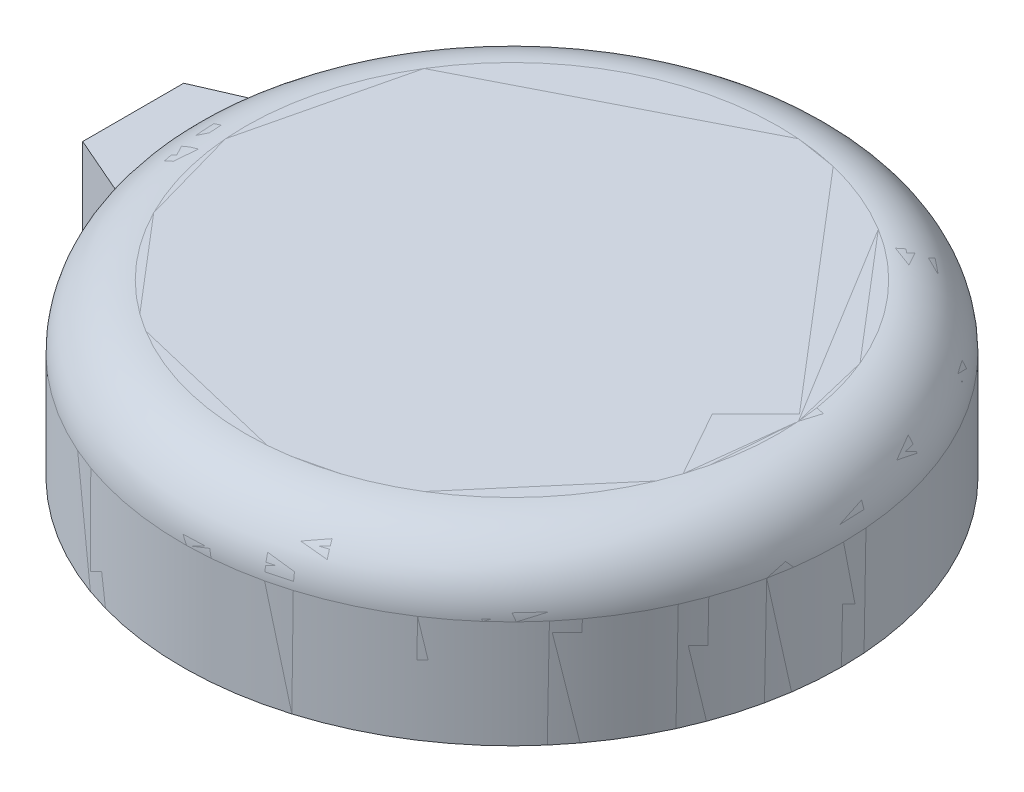
ISO-10303-21;
HEADER;
FILE_DESCRIPTION(('STEP AP214'),'2;1');
FILE_NAME('part.step','',(''),(''),'','','');
FILE_SCHEMA(('AUTOMOTIVE_DESIGN { 1 0 10303 214 1 1 1 1 }'));
ENDSEC;
DATA;
#1=APPLICATION_CONTEXT('core data for automotive mechanical design processes');
#2=APPLICATION_PROTOCOL_DEFINITION('international standard','automotive_design',2000,#1);
#3=PRODUCT_CONTEXT('',#1,'mechanical');
#4=PRODUCT('Part','Part','',(#3));
#5=PRODUCT_RELATED_PRODUCT_CATEGORY('part','',(#4));
#6=PRODUCT_DEFINITION_FORMATION('','',#4);
#7=PRODUCT_DEFINITION_CONTEXT('part definition',#1,'design');
#8=PRODUCT_DEFINITION('design','',#6,#7);
#9=PRODUCT_DEFINITION_SHAPE('','',#8);
#10=(LENGTH_UNIT() NAMED_UNIT(*) SI_UNIT(.MILLI.,.METRE.));
#11=(NAMED_UNIT(*) PLANE_ANGLE_UNIT() SI_UNIT($,.RADIAN.));
#12=(NAMED_UNIT(*) SI_UNIT($,.STERADIAN.) SOLID_ANGLE_UNIT());
#13=UNCERTAINTY_MEASURE_WITH_UNIT(LENGTH_MEASURE(1.E-05),#10,'distance_accuracy_value','');
#14=(GEOMETRIC_REPRESENTATION_CONTEXT(3) GLOBAL_UNCERTAINTY_ASSIGNED_CONTEXT((#13)) GLOBAL_UNIT_ASSIGNED_CONTEXT((#10,
#11,#12)) REPRESENTATION_CONTEXT('',''));
#15=CARTESIAN_POINT('',(0.,0.,0.));
#16=DIRECTION('',(0.,0.,1.));
#17=DIRECTION('',(1.,0.,0.));
#18=AXIS2_PLACEMENT_3D('',#15,#16,#17);
#19=CARTESIAN_POINT('',(26.1,0.,0.));
#20=DIRECTION('',(0.,-1.,0.));
#21=DIRECTION('',(0.,0.,-1.));
#22=AXIS2_PLACEMENT_3D('',#19,#20,#21);
#23=PLANE('',#22);
#24=CARTESIAN_POINT('',(0.,0.,0.));
#25=DIRECTION('',(0.,1.,0.));
#26=DIRECTION('',(1.,0.,0.));
#27=AXIS2_PLACEMENT_3D('',#24,#25,#26);
#28=CIRCLE('',#27,26.1);
#29=CARTESIAN_POINT('',(-25.4009842328993,0.,6.));
#30=VERTEX_POINT('',#29);
#31=CARTESIAN_POINT('',(-25.4009842328993,0.,-6.));
#32=VERTEX_POINT('',#31);
#33=EDGE_CURVE('P0_E82',#30,#32,#28,.T.);
#34=ORIENTED_EDGE('',*,*,#33,.F.);
#35=DIRECTION('',(-0.917038852333646,0.,-0.398797872750834));
#36=VECTOR('',#35,1.);
#37=CARTESIAN_POINT('',(-25.4009842328993,0.,6.));
#38=LINE('',#37,#36);
#39=CARTESIAN_POINT('',(-30.,0.,4.));
#40=VERTEX_POINT('',#39);
#41=EDGE_CURVE('P0_E112',#30,#40,#38,.T.);
#42=ORIENTED_EDGE('',*,*,#41,.T.);
#43=DIRECTION('',(0.,0.,-1.));
#44=VECTOR('',#43,1.);
#45=CARTESIAN_POINT('',(-30.,0.,4.));
#46=LINE('',#45,#44);
#47=CARTESIAN_POINT('',(-30.,0.,-4.));
#48=VERTEX_POINT('',#47);
#49=EDGE_CURVE('P0_E75',#40,#48,#46,.T.);
#50=ORIENTED_EDGE('',*,*,#49,.T.);
#51=DIRECTION('',(0.917038852333646,0.,-0.398797872750834));
#52=VECTOR('',#51,1.);
#53=CARTESIAN_POINT('',(-30.,0.,-4.));
#54=LINE('',#53,#52);
#55=EDGE_CURVE('P0_E99',#48,#32,#54,.T.);
#56=ORIENTED_EDGE('',*,*,#55,.T.);
#57=EDGE_LOOP('',(#34,#42,#50,#56));
#58=FACE_BOUND('',#57,.T.);
#59=ADVANCED_FACE('P0_F32',(#58),#23,.T.);
#60=CARTESIAN_POINT('',(0.,13.5,0.));
#61=DIRECTION('',(0.,1.,0.));
#62=DIRECTION('',(1.,0.,0.));
#63=AXIS2_PLACEMENT_3D('',#60,#61,#62);
#64=PLANE('',#63);
#65=CARTESIAN_POINT('',(0.,13.5,0.));
#66=DIRECTION('',(0.,1.,0.));
#67=DIRECTION('',(1.,0.,0.));
#68=AXIS2_PLACEMENT_3D('',#65,#66,#67);
#69=CIRCLE('',#68,21.1);
#70=CARTESIAN_POINT('',(0.,13.5,-21.1));
#71=VERTEX_POINT('',#70);
#72=EDGE_CURVE('P0_E129',#71,#71,#69,.T.);
#73=ORIENTED_EDGE('',*,*,#72,.T.);
#74=EDGE_LOOP('',(#73));
#75=FACE_BOUND('',#74,.T.);
#76=ADVANCED_FACE('P0_F169',(#75),#64,.T.);
#77=CARTESIAN_POINT('',(0.,8.5,0.));
#78=DIRECTION('',(0.,1.,0.));
#79=DIRECTION('',(0.,0.,1.));
#80=AXIS2_PLACEMENT_3D('',#77,#78,#79);
#81=TOROIDAL_SURFACE('',#80,21.1,5.);
#82=ORIENTED_EDGE('',*,*,#72,.F.);
#83=CARTESIAN_POINT('',(0.,8.5,-21.1));
#84=DIRECTION('',(-1.,0.,0.));
#85=DIRECTION('',(0.,0.,-1.));
#86=AXIS2_PLACEMENT_3D('',#83,#84,#85);
#87=CIRCLE('',#86,5.);
#88=CARTESIAN_POINT('',(0.,8.5,-26.1));
#89=VERTEX_POINT('',#88);
#90=EDGE_CURVE('P0_E42',#71,#89,#87,.T.);
#91=ORIENTED_EDGE('',*,*,#90,.T.);
#92=CARTESIAN_POINT('',(0.,8.5,0.));
#93=DIRECTION('',(0.,1.,0.));
#94=DIRECTION('',(1.,0.,0.));
#95=AXIS2_PLACEMENT_3D('',#92,#93,#94);
#96=CIRCLE('',#95,26.1);
#97=CARTESIAN_POINT('',(-25.4009842328993,8.5,-6.));
#98=VERTEX_POINT('',#97);
#99=EDGE_CURVE('P0_E140',#89,#98,#96,.T.);
#100=ORIENTED_EDGE('',*,*,#99,.T.);
#101=CARTESIAN_POINT('',(0.,8.5,0.));
#102=DIRECTION('',(0.,1.,0.));
#103=DIRECTION('',(1.,0.,0.));
#104=AXIS2_PLACEMENT_3D('',#101,#102,#103);
#105=CIRCLE('',#104,26.1);
#106=CARTESIAN_POINT('',(-25.4009842328993,8.5,6.));
#107=VERTEX_POINT('',#106);
#108=EDGE_CURVE('P0_E117',#98,#107,#105,.T.);
#109=ORIENTED_EDGE('',*,*,#108,.T.);
#110=CARTESIAN_POINT('',(0.,8.5,0.));
#111=DIRECTION('',(0.,1.,0.));
#112=DIRECTION('',(1.,0.,0.));
#113=AXIS2_PLACEMENT_3D('',#110,#111,#112);
#114=CIRCLE('',#113,26.1);
#115=EDGE_CURVE('P0_E131',#107,#89,#114,.T.);
#116=ORIENTED_EDGE('',*,*,#115,.T.);
#117=ORIENTED_EDGE('',*,*,#90,.F.);
#118=EDGE_LOOP('',(#82,#91,#100,#109,#116,#117));
#119=FACE_BOUND('',#118,.T.);
#120=ADVANCED_FACE('P0_F173',(#119),#81,.T.);
#121=CARTESIAN_POINT('',(0.,4.25,0.));
#122=DIRECTION('',(0.,1.,0.));
#123=DIRECTION('',(1.,0.,0.));
#124=AXIS2_PLACEMENT_3D('',#121,#122,#123);
#125=CYLINDRICAL_SURFACE('',#124,26.1);
#126=DIRECTION('',(0.,-1.,0.));
#127=VECTOR('',#126,1.);
#128=CARTESIAN_POINT('',(-25.4009842328993,4.25,6.));
#129=LINE('',#128,#127);
#130=EDGE_CURVE('P0_E123',#107,#30,#129,.T.);
#131=ORIENTED_EDGE('',*,*,#130,.T.);
#132=ORIENTED_EDGE('',*,*,#33,.T.);
#133=DIRECTION('',(0.,1.,0.));
#134=VECTOR('',#133,1.);
#135=CARTESIAN_POINT('',(-25.4009842328993,4.25,-6.));
#136=LINE('',#135,#134);
#137=EDGE_CURVE('P0_E105',#32,#98,#136,.T.);
#138=ORIENTED_EDGE('',*,*,#137,.T.);
#139=ORIENTED_EDGE('',*,*,#99,.F.);
#140=ORIENTED_EDGE('',*,*,#115,.F.);
#141=EDGE_LOOP('',(#131,#132,#138,#139,#140));
#142=FACE_BOUND('',#141,.T.);
#143=ADVANCED_FACE('P0_F177',(#142),#125,.T.);
#144=CARTESIAN_POINT('',(-27.7004921164497,10.,0.));
#145=DIRECTION('',(0.,-1.,0.));
#146=DIRECTION('',(0.,0.,-1.));
#147=AXIS2_PLACEMENT_3D('',#144,#145,#146);
#148=PLANE('',#147);
#149=DIRECTION('',(-0.917038852333646,0.,0.398797872750834));
#150=VECTOR('',#149,1.);
#151=CARTESIAN_POINT('',(-30.,10.,-4.));
#152=LINE('',#151,#150);
#153=CARTESIAN_POINT('',(-25.4009842328993,10.,-6.));
#154=VERTEX_POINT('',#153);
#155=CARTESIAN_POINT('',(-30.,10.,-4.));
#156=VERTEX_POINT('',#155);
#157=EDGE_CURVE('P0_E106',#154,#156,#152,.T.);
#158=ORIENTED_EDGE('',*,*,#157,.T.);
#159=DIRECTION('',(0.,0.,1.));
#160=VECTOR('',#159,1.);
#161=CARTESIAN_POINT('',(-30.,10.,4.));
#162=LINE('',#161,#160);
#163=CARTESIAN_POINT('',(-30.,10.,4.));
#164=VERTEX_POINT('',#163);
#165=EDGE_CURVE('P0_E109',#156,#164,#162,.T.);
#166=ORIENTED_EDGE('',*,*,#165,.T.);
#167=DIRECTION('',(0.917038852333646,0.,0.398797872750834));
#168=VECTOR('',#167,1.);
#169=CARTESIAN_POINT('',(-25.4009842328993,10.,6.));
#170=LINE('',#169,#168);
#171=CARTESIAN_POINT('',(-25.4009842328993,10.,6.));
#172=VERTEX_POINT('',#171);
#173=EDGE_CURVE('P0_E88',#164,#172,#170,.T.);
#174=ORIENTED_EDGE('',*,*,#173,.T.);
#175=CARTESIAN_POINT('',(0.,10.,0.));
#176=DIRECTION('',(0.,-1.,0.));
#177=DIRECTION('',(-1.,0.,0.));
#178=AXIS2_PLACEMENT_3D('',#175,#176,#177);
#179=CIRCLE('',#178,26.1);
#180=EDGE_CURVE('P0_E126',#172,#154,#179,.T.);
#181=ORIENTED_EDGE('',*,*,#180,.T.);
#182=EDGE_LOOP('',(#158,#166,#174,#181));
#183=FACE_BOUND('',#182,.T.);
#184=ADVANCED_FACE('P0_F34',(#183),#148,.F.);
#185=CARTESIAN_POINT('',(-25.4009842328993,0.,-6.));
#186=DIRECTION('',(-0.398797872750833,0.,-0.917038852333646));
#187=DIRECTION('',(-0.917038852333646,0.,0.398797872750833));
#188=AXIS2_PLACEMENT_3D('',#185,#186,#187);
#189=PLANE('',#188);
#190=ORIENTED_EDGE('',*,*,#55,.F.);
#191=DIRECTION('',(0.,1.,0.));
#192=VECTOR('',#191,1.);
#193=CARTESIAN_POINT('',(-30.,0.,-4.));
#194=LINE('',#193,#192);
#195=EDGE_CURVE('P0_E101',#48,#156,#194,.T.);
#196=ORIENTED_EDGE('',*,*,#195,.T.);
#197=ORIENTED_EDGE('',*,*,#157,.F.);
#198=DIRECTION('',(0.,1.,0.));
#199=VECTOR('',#198,1.);
#200=CARTESIAN_POINT('',(-25.4009842328993,0.,-6.));
#201=LINE('',#200,#199);
#202=EDGE_CURVE('P0_E120',#98,#154,#201,.T.);
#203=ORIENTED_EDGE('',*,*,#202,.F.);
#204=ORIENTED_EDGE('',*,*,#137,.F.);
#205=EDGE_LOOP('',(#190,#196,#197,#203,#204));
#206=FACE_BOUND('',#205,.T.);
#207=ADVANCED_FACE('P0_F100',(#206),#189,.T.);
#208=CARTESIAN_POINT('',(-30.,0.,-4.));
#209=DIRECTION('',(-1.,0.,0.));
#210=DIRECTION('',(0.,0.,1.));
#211=AXIS2_PLACEMENT_3D('',#208,#209,#210);
#212=PLANE('',#211);
#213=CARTESIAN_POINT('',(-30.,5.00000000000001,0.));
#214=DIRECTION('',(-1.,0.,0.));
#215=DIRECTION('',(0.,0.,1.));
#216=AXIS2_PLACEMENT_3D('',#213,#214,#215);
#217=CIRCLE('',#216,1.5);
#218=CARTESIAN_POINT('',(-30.,5.00000000000001,1.5));
#219=VERTEX_POINT('',#218);
#220=EDGE_CURVE('P0_E11',#219,#219,#217,.T.);
#221=ORIENTED_EDGE('',*,*,#220,.F.);
#222=EDGE_LOOP('',(#221));
#223=FACE_BOUND('',#222,.T.);
#224=ORIENTED_EDGE('',*,*,#49,.F.);
#225=DIRECTION('',(0.,1.,0.));
#226=VECTOR('',#225,1.);
#227=CARTESIAN_POINT('',(-30.,0.,4.));
#228=LINE('',#227,#226);
#229=EDGE_CURVE('P0_E36',#40,#164,#228,.T.);
#230=ORIENTED_EDGE('',*,*,#229,.T.);
#231=ORIENTED_EDGE('',*,*,#165,.F.);
#232=ORIENTED_EDGE('',*,*,#195,.F.);
#233=EDGE_LOOP('',(#224,#230,#231,#232));
#234=FACE_BOUND('',#233,.T.);
#235=ADVANCED_FACE('P0_F108',(#223,#234),#212,.T.);
#236=CARTESIAN_POINT('',(-30.,0.,4.));
#237=DIRECTION('',(-0.398797872750833,0.,0.917038852333646));
#238=DIRECTION('',(0.,1.,0.));
#239=AXIS2_PLACEMENT_3D('',#236,#237,#238);
#240=PLANE('',#239);
#241=ORIENTED_EDGE('',*,*,#41,.F.);
#242=ORIENTED_EDGE('',*,*,#130,.F.);
#243=DIRECTION('',(0.,1.,0.));
#244=VECTOR('',#243,1.);
#245=CARTESIAN_POINT('',(-25.4009842328993,0.,6.));
#246=LINE('',#245,#244);
#247=EDGE_CURVE('P0_E133',#107,#172,#246,.T.);
#248=ORIENTED_EDGE('',*,*,#247,.T.);
#249=ORIENTED_EDGE('',*,*,#173,.F.);
#250=ORIENTED_EDGE('',*,*,#229,.F.);
#251=EDGE_LOOP('',(#241,#242,#248,#249,#250));
#252=FACE_BOUND('',#251,.T.);
#253=ADVANCED_FACE('P0_F159',(#252),#240,.T.);
#254=CARTESIAN_POINT('',(0.,0.,0.));
#255=DIRECTION('',(0.,1.,0.));
#256=DIRECTION('',(-1.,0.,0.));
#257=AXIS2_PLACEMENT_3D('',#254,#255,#256);
#258=CYLINDRICAL_SURFACE('',#257,26.1);
#259=ORIENTED_EDGE('',*,*,#108,.F.);
#260=ORIENTED_EDGE('',*,*,#202,.T.);
#261=ORIENTED_EDGE('',*,*,#180,.F.);
#262=ORIENTED_EDGE('',*,*,#247,.F.);
#263=EDGE_LOOP('',(#259,#260,#261,#262));
#264=FACE_BOUND('',#263,.T.);
#265=ADVANCED_FACE('P0_F154',(#264),#258,.F.);
#266=CARTESIAN_POINT('',(-31.,5.00000000000001,0.));
#267=DIRECTION('',(1.,0.,0.));
#268=DIRECTION('',(0.,0.,-1.));
#269=AXIS2_PLACEMENT_3D('',#266,#267,#268);
#270=CYLINDRICAL_SURFACE('',#269,1.5);
#271=CARTESIAN_POINT('',(-31.,5.00000000000001,0.));
#272=DIRECTION('',(-1.,0.,0.));
#273=DIRECTION('',(0.,0.,1.));
#274=AXIS2_PLACEMENT_3D('',#271,#272,#273);
#275=CIRCLE('',#274,1.5);
#276=CARTESIAN_POINT('',(-31.,5.00000000000001,1.5));
#277=VERTEX_POINT('',#276);
#278=EDGE_CURVE('P0_E121',#277,#277,#275,.T.);
#279=ORIENTED_EDGE('',*,*,#278,.F.);
#280=EDGE_LOOP('',(#279));
#281=FACE_BOUND('',#280,.T.);
#282=ORIENTED_EDGE('',*,*,#220,.T.);
#283=EDGE_LOOP('',(#282));
#284=FACE_BOUND('',#283,.T.);
#285=ADVANCED_FACE('P0_F151',(#281,#284),#270,.T.);
#286=CARTESIAN_POINT('',(-31.,5.00000000000001,0.));
#287=DIRECTION('',(-1.,0.,0.));
#288=DIRECTION('',(0.,0.,1.));
#289=AXIS2_PLACEMENT_3D('',#286,#287,#288);
#290=PLANE('',#289);
#291=ORIENTED_EDGE('',*,*,#278,.T.);
#292=EDGE_LOOP('',(#291));
#293=FACE_BOUND('',#292,.T.);
#294=ADVANCED_FACE('P0_F149',(#293),#290,.T.);
#295=CLOSED_SHELL('',(#59,#76,#120,#143,#184,#207,#235,#253,#265,#285,#294));
#296=MANIFOLD_SOLID_BREP('P0_B2',#295);
#297=CARTESIAN_POINT('',(26.1,0.,0.));
#298=DIRECTION('',(0.,-1.,0.));
#299=DIRECTION('',(0.,0.,-1.));
#300=AXIS2_PLACEMENT_3D('',#297,#298,#299);
#301=PLANE('',#300);
#302=CARTESIAN_POINT('',(0.,0.,0.));
#303=DIRECTION('',(0.,1.,0.));
#304=DIRECTION('',(1.,0.,0.));
#305=AXIS2_PLACEMENT_3D('',#302,#303,#304);
#306=CIRCLE('',#305,26.1);
#307=CARTESIAN_POINT('',(-25.4009842328993,0.,6.));
#308=VERTEX_POINT('',#307);
#309=CARTESIAN_POINT('',(-25.4009842328993,0.,-6.));
#310=VERTEX_POINT('',#309);
#311=EDGE_CURVE('P1_E79',#308,#310,#306,.T.);
#312=ORIENTED_EDGE('',*,*,#311,.F.);
#313=DIRECTION('',(-0.917038852333646,0.,-0.398797872750834));
#314=VECTOR('',#313,1.);
#315=CARTESIAN_POINT('',(-25.4009842328993,0.,6.));
#316=LINE('',#315,#314);
#317=CARTESIAN_POINT('',(-30.,0.,4.));
#318=VERTEX_POINT('',#317);
#319=EDGE_CURVE('P1_E116',#308,#318,#316,.T.);
#320=ORIENTED_EDGE('',*,*,#319,.T.);
#321=DIRECTION('',(0.,0.,-1.));
#322=VECTOR('',#321,1.);
#323=CARTESIAN_POINT('',(-30.,0.,4.));
#324=LINE('',#323,#322);
#325=CARTESIAN_POINT('',(-30.,0.,-4.));
#326=VERTEX_POINT('',#325);
#327=EDGE_CURVE('P1_E70',#318,#326,#324,.T.);
#328=ORIENTED_EDGE('',*,*,#327,.T.);
#329=DIRECTION('',(0.917038852333646,0.,-0.398797872750834));
#330=VECTOR('',#329,1.);
#331=CARTESIAN_POINT('',(-30.,0.,-4.));
#332=LINE('',#331,#330);
#333=EDGE_CURVE('P1_E101',#326,#310,#332,.T.);
#334=ORIENTED_EDGE('',*,*,#333,.T.);
#335=EDGE_LOOP('',(#312,#320,#328,#334));
#336=FACE_BOUND('',#335,.T.);
#337=ADVANCED_FACE('P1_F16',(#336),#301,.T.);
#338=CARTESIAN_POINT('',(0.,13.5,0.));
#339=DIRECTION('',(0.,1.,0.));
#340=DIRECTION('',(1.,0.,0.));
#341=AXIS2_PLACEMENT_3D('',#338,#339,#340);
#342=PLANE('',#341);
#343=CARTESIAN_POINT('',(0.,13.5,0.));
#344=DIRECTION('',(0.,1.,0.));
#345=DIRECTION('',(1.,0.,0.));
#346=AXIS2_PLACEMENT_3D('',#343,#344,#345);
#347=CIRCLE('',#346,21.1);
#348=CARTESIAN_POINT('',(0.,13.5,-21.1));
#349=VERTEX_POINT('',#348);
#350=EDGE_CURVE('P1_E27',#349,#349,#347,.T.);
#351=ORIENTED_EDGE('',*,*,#350,.T.);
#352=EDGE_LOOP('',(#351));
#353=FACE_BOUND('',#352,.T.);
#354=ADVANCED_FACE('P1_F180',(#353),#342,.T.);
#355=CARTESIAN_POINT('',(0.,8.5,0.));
#356=DIRECTION('',(0.,1.,0.));
#357=DIRECTION('',(0.,0.,1.));
#358=AXIS2_PLACEMENT_3D('',#355,#356,#357);
#359=TOROIDAL_SURFACE('',#358,21.1,5.);
#360=ORIENTED_EDGE('',*,*,#350,.F.);
#361=CARTESIAN_POINT('',(0.,8.5,-21.1));
#362=DIRECTION('',(-1.,0.,0.));
#363=DIRECTION('',(0.,0.,-1.));
#364=AXIS2_PLACEMENT_3D('',#361,#362,#363);
#365=CIRCLE('',#364,5.);
#366=CARTESIAN_POINT('',(0.,8.5,-26.1));
#367=VERTEX_POINT('',#366);
#368=EDGE_CURVE('P1_E11',#349,#367,#365,.T.);
#369=ORIENTED_EDGE('',*,*,#368,.T.);
#370=CARTESIAN_POINT('',(0.,8.5,0.));
#371=DIRECTION('',(0.,1.,0.));
#372=DIRECTION('',(1.,0.,0.));
#373=AXIS2_PLACEMENT_3D('',#370,#371,#372);
#374=CIRCLE('',#373,26.1);
#375=CARTESIAN_POINT('',(-25.4009842328993,8.5,-6.));
#376=VERTEX_POINT('',#375);
#377=EDGE_CURVE('P1_E158',#367,#376,#374,.T.);
#378=ORIENTED_EDGE('',*,*,#377,.T.);
#379=CARTESIAN_POINT('',(0.,8.5,0.));
#380=DIRECTION('',(0.,1.,0.));
#381=DIRECTION('',(1.,0.,0.));
#382=AXIS2_PLACEMENT_3D('',#379,#380,#381);
#383=CIRCLE('',#382,26.1);
#384=CARTESIAN_POINT('',(-25.4009842328993,8.5,6.));
#385=VERTEX_POINT('',#384);
#386=EDGE_CURVE('P1_E125',#376,#385,#383,.T.);
#387=ORIENTED_EDGE('',*,*,#386,.T.);
#388=CARTESIAN_POINT('',(0.,8.5,0.));
#389=DIRECTION('',(0.,1.,0.));
#390=DIRECTION('',(1.,0.,0.));
#391=AXIS2_PLACEMENT_3D('',#388,#389,#390);
#392=CIRCLE('',#391,26.1);
#393=EDGE_CURVE('P1_E142',#385,#367,#392,.T.);
#394=ORIENTED_EDGE('',*,*,#393,.T.);
#395=ORIENTED_EDGE('',*,*,#368,.F.);
#396=EDGE_LOOP('',(#360,#369,#378,#387,#394,#395));
#397=FACE_BOUND('',#396,.T.);
#398=ADVANCED_FACE('P1_F171',(#397),#359,.T.);
#399=CARTESIAN_POINT('',(0.,4.25,0.));
#400=DIRECTION('',(0.,1.,0.));
#401=DIRECTION('',(1.,0.,0.));
#402=AXIS2_PLACEMENT_3D('',#399,#400,#401);
#403=CYLINDRICAL_SURFACE('',#402,26.1);
#404=DIRECTION('',(0.,-1.,0.));
#405=VECTOR('',#404,1.);
#406=CARTESIAN_POINT('',(-25.4009842328993,4.25,6.));
#407=LINE('',#406,#405);
#408=EDGE_CURVE('P1_E131',#385,#308,#407,.T.);
#409=ORIENTED_EDGE('',*,*,#408,.T.);
#410=ORIENTED_EDGE('',*,*,#311,.T.);
#411=DIRECTION('',(0.,1.,0.));
#412=VECTOR('',#411,1.);
#413=CARTESIAN_POINT('',(-25.4009842328993,4.25,-6.));
#414=LINE('',#413,#412);
#415=EDGE_CURVE('P1_E107',#310,#376,#414,.T.);
#416=ORIENTED_EDGE('',*,*,#415,.T.);
#417=ORIENTED_EDGE('',*,*,#377,.F.);
#418=ORIENTED_EDGE('',*,*,#393,.F.);
#419=EDGE_LOOP('',(#409,#410,#416,#417,#418));
#420=FACE_BOUND('',#419,.T.);
#421=ADVANCED_FACE('P1_F172',(#420),#403,.T.);
#422=CARTESIAN_POINT('',(-27.7004921164497,10.,0.));
#423=DIRECTION('',(0.,-1.,0.));
#424=DIRECTION('',(0.,0.,-1.));
#425=AXIS2_PLACEMENT_3D('',#422,#423,#424);
#426=PLANE('',#425);
#427=DIRECTION('',(-0.917038852333646,0.,0.398797872750834));
#428=VECTOR('',#427,1.);
#429=CARTESIAN_POINT('',(-30.,10.,-4.));
#430=LINE('',#429,#428);
#431=CARTESIAN_POINT('',(-25.4009842328993,10.,-6.));
#432=VERTEX_POINT('',#431);
#433=CARTESIAN_POINT('',(-30.,10.,-4.));
#434=VERTEX_POINT('',#433);
#435=EDGE_CURVE('P1_E109',#432,#434,#430,.T.);
#436=ORIENTED_EDGE('',*,*,#435,.T.);
#437=DIRECTION('',(0.,0.,1.));
#438=VECTOR('',#437,1.);
#439=CARTESIAN_POINT('',(-30.,10.,4.));
#440=LINE('',#439,#438);
#441=CARTESIAN_POINT('',(-30.,10.,4.));
#442=VERTEX_POINT('',#441);
#443=EDGE_CURVE('P1_E112',#434,#442,#440,.T.);
#444=ORIENTED_EDGE('',*,*,#443,.T.);
#445=DIRECTION('',(0.917038852333646,0.,0.398797872750834));
#446=VECTOR('',#445,1.);
#447=CARTESIAN_POINT('',(-25.4009842328993,10.,6.));
#448=LINE('',#447,#446);
#449=CARTESIAN_POINT('',(-25.4009842328993,10.,6.));
#450=VERTEX_POINT('',#449);
#451=EDGE_CURVE('P1_E87',#442,#450,#448,.T.);
#452=ORIENTED_EDGE('',*,*,#451,.T.);
#453=CARTESIAN_POINT('',(0.,10.,0.));
#454=DIRECTION('',(0.,-1.,0.));
#455=DIRECTION('',(-1.,0.,0.));
#456=AXIS2_PLACEMENT_3D('',#453,#454,#455);
#457=CIRCLE('',#456,26.1);
#458=EDGE_CURVE('P1_E135',#450,#432,#457,.T.);
#459=ORIENTED_EDGE('',*,*,#458,.T.);
#460=EDGE_LOOP('',(#436,#444,#452,#459));
#461=FACE_BOUND('',#460,.T.);
#462=ADVANCED_FACE('P1_F18',(#461),#426,.F.);
#463=CARTESIAN_POINT('',(-25.4009842328993,0.,-6.));
#464=DIRECTION('',(-0.398797872750833,0.,-0.917038852333646));
#465=DIRECTION('',(-0.917038852333646,0.,0.398797872750833));
#466=AXIS2_PLACEMENT_3D('',#463,#464,#465);
#467=PLANE('',#466);
#468=ORIENTED_EDGE('',*,*,#333,.F.);
#469=DIRECTION('',(0.,1.,0.));
#470=VECTOR('',#469,1.);
#471=CARTESIAN_POINT('',(-30.,0.,-4.));
#472=LINE('',#471,#470);
#473=EDGE_CURVE('P1_E103',#326,#434,#472,.T.);
#474=ORIENTED_EDGE('',*,*,#473,.T.);
#475=ORIENTED_EDGE('',*,*,#435,.F.);
#476=DIRECTION('',(0.,1.,0.));
#477=VECTOR('',#476,1.);
#478=CARTESIAN_POINT('',(-25.4009842328993,0.,-6.));
#479=LINE('',#478,#477);
#480=EDGE_CURVE('P1_E128',#376,#432,#479,.T.);
#481=ORIENTED_EDGE('',*,*,#480,.F.);
#482=ORIENTED_EDGE('',*,*,#415,.F.);
#483=EDGE_LOOP('',(#468,#474,#475,#481,#482));
#484=FACE_BOUND('',#483,.T.);
#485=ADVANCED_FACE('P1_F102',(#484),#467,.T.);
#486=CARTESIAN_POINT('',(-30.,0.,-4.));
#487=DIRECTION('',(-1.,0.,0.));
#488=DIRECTION('',(0.,0.,1.));
#489=AXIS2_PLACEMENT_3D('',#486,#487,#488);
#490=PLANE('',#489);
#491=ORIENTED_EDGE('',*,*,#327,.F.);
#492=DIRECTION('',(0.,1.,0.));
#493=VECTOR('',#492,1.);
#494=CARTESIAN_POINT('',(-30.,0.,4.));
#495=LINE('',#494,#493);
#496=EDGE_CURVE('P1_E20',#318,#442,#495,.T.);
#497=ORIENTED_EDGE('',*,*,#496,.T.);
#498=ORIENTED_EDGE('',*,*,#443,.F.);
#499=ORIENTED_EDGE('',*,*,#473,.F.);
#500=EDGE_LOOP('',(#491,#497,#498,#499));
#501=FACE_BOUND('',#500,.T.);
#502=ADVANCED_FACE('P1_F111',(#501),#490,.T.);
#503=CARTESIAN_POINT('',(-30.,0.,4.));
#504=DIRECTION('',(-0.398797872750833,0.,0.917038852333646));
#505=DIRECTION('',(0.,1.,0.));
#506=AXIS2_PLACEMENT_3D('',#503,#504,#505);
#507=PLANE('',#506);
#508=ORIENTED_EDGE('',*,*,#319,.F.);
#509=ORIENTED_EDGE('',*,*,#408,.F.);
#510=DIRECTION('',(0.,1.,0.));
#511=VECTOR('',#510,1.);
#512=CARTESIAN_POINT('',(-25.4009842328993,0.,6.));
#513=LINE('',#512,#511);
#514=EDGE_CURVE('P1_E145',#385,#450,#513,.T.);
#515=ORIENTED_EDGE('',*,*,#514,.T.);
#516=ORIENTED_EDGE('',*,*,#451,.F.);
#517=ORIENTED_EDGE('',*,*,#496,.F.);
#518=EDGE_LOOP('',(#508,#509,#515,#516,#517));
#519=FACE_BOUND('',#518,.T.);
#520=ADVANCED_FACE('P1_F192',(#519),#507,.T.);
#521=CARTESIAN_POINT('',(0.,0.,0.));
#522=DIRECTION('',(0.,1.,0.));
#523=DIRECTION('',(-1.,0.,0.));
#524=AXIS2_PLACEMENT_3D('',#521,#522,#523);
#525=CYLINDRICAL_SURFACE('',#524,26.1);
#526=ORIENTED_EDGE('',*,*,#386,.F.);
#527=ORIENTED_EDGE('',*,*,#480,.T.);
#528=ORIENTED_EDGE('',*,*,#458,.F.);
#529=ORIENTED_EDGE('',*,*,#514,.F.);
#530=EDGE_LOOP('',(#526,#527,#528,#529));
#531=FACE_BOUND('',#530,.T.);
#532=ADVANCED_FACE('P1_F170',(#531),#525,.F.);
#533=CLOSED_SHELL('',(#337,#354,#398,#421,#462,#485,#502,#520,#532));
#534=MANIFOLD_SOLID_BREP('P1_B1',#533);
#535=ADVANCED_BREP_SHAPE_REPRESENTATION('',(#18,#296,#534),#14);
#536=SHAPE_DEFINITION_REPRESENTATION(#9,#535);
ENDSEC;
END-ISO-10303-21;
